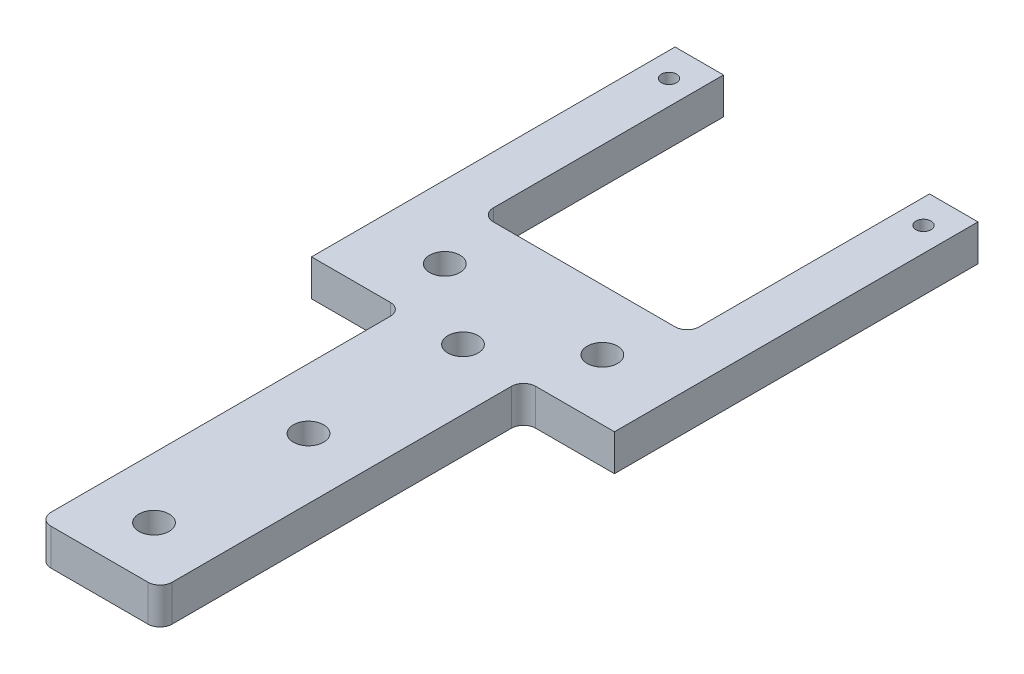
ISO-10303-21;
HEADER;
FILE_DESCRIPTION(('STEP AP214'),'2;1');
FILE_NAME('part.step','',(''),(''),'','','');
FILE_SCHEMA(('AUTOMOTIVE_DESIGN { 1 0 10303 214 1 1 1 1 }'));
ENDSEC;
DATA;
#1=APPLICATION_CONTEXT('core data for automotive mechanical design processes');
#2=APPLICATION_PROTOCOL_DEFINITION('international standard','automotive_design',2000,#1);
#3=PRODUCT_CONTEXT('',#1,'mechanical');
#4=PRODUCT('Part','Part','',(#3));
#5=PRODUCT_RELATED_PRODUCT_CATEGORY('part','',(#4));
#6=PRODUCT_DEFINITION_FORMATION('','',#4);
#7=PRODUCT_DEFINITION_CONTEXT('part definition',#1,'design');
#8=PRODUCT_DEFINITION('design','',#6,#7);
#9=PRODUCT_DEFINITION_SHAPE('','',#8);
#10=(LENGTH_UNIT() NAMED_UNIT(*) SI_UNIT(.MILLI.,.METRE.));
#11=(NAMED_UNIT(*) PLANE_ANGLE_UNIT() SI_UNIT($,.RADIAN.));
#12=(NAMED_UNIT(*) SI_UNIT($,.STERADIAN.) SOLID_ANGLE_UNIT());
#13=UNCERTAINTY_MEASURE_WITH_UNIT(LENGTH_MEASURE(1.E-05),#10,'distance_accuracy_value','');
#14=(GEOMETRIC_REPRESENTATION_CONTEXT(3) GLOBAL_UNCERTAINTY_ASSIGNED_CONTEXT((#13)) GLOBAL_UNIT_ASSIGNED_CONTEXT((#10,
#11,#12)) REPRESENTATION_CONTEXT('',''));
#15=CARTESIAN_POINT('',(0.,0.,0.));
#16=DIRECTION('',(0.,0.,1.));
#17=DIRECTION('',(1.,0.,0.));
#18=AXIS2_PLACEMENT_3D('',#15,#16,#17);
#19=CARTESIAN_POINT('',(0.,1.5,-10.));
#20=DIRECTION('',(0.,0.,-1.));
#21=DIRECTION('',(-1.,0.,0.));
#22=AXIS2_PLACEMENT_3D('',#19,#20,#21);
#23=PLANE('',#22);
#24=DIRECTION('',(1.,0.,0.));
#25=VECTOR('',#24,1.);
#26=CARTESIAN_POINT('',(0.,1.5,-10.));
#27=LINE('',#26,#25);
#28=CARTESIAN_POINT('',(-7.5,1.5,-10.));
#29=VERTEX_POINT('',#28);
#30=CARTESIAN_POINT('',(7.5,1.5,-10.));
#31=VERTEX_POINT('',#30);
#32=EDGE_CURVE('E173',#29,#31,#27,.T.);
#33=ORIENTED_EDGE('',*,*,#32,.T.);
#34=DIRECTION('',(0.,-1.,0.));
#35=VECTOR('',#34,1.);
#36=CARTESIAN_POINT('',(7.5,-1.5,-10.));
#37=LINE('',#36,#35);
#38=CARTESIAN_POINT('',(7.5,-1.5,-10.));
#39=VERTEX_POINT('',#38);
#40=EDGE_CURVE('E325',#31,#39,#37,.T.);
#41=ORIENTED_EDGE('',*,*,#40,.T.);
#42=DIRECTION('',(1.,0.,0.));
#43=VECTOR('',#42,1.);
#44=CARTESIAN_POINT('',(0.,-1.5,-10.));
#45=LINE('',#44,#43);
#46=CARTESIAN_POINT('',(-7.5,-1.5,-10.));
#47=VERTEX_POINT('',#46);
#48=EDGE_CURVE('E234',#47,#39,#45,.T.);
#49=ORIENTED_EDGE('',*,*,#48,.F.);
#50=DIRECTION('',(0.,-1.,0.));
#51=VECTOR('',#50,1.);
#52=CARTESIAN_POINT('',(-7.5,1.5,-10.));
#53=LINE('',#52,#51);
#54=EDGE_CURVE('E323',#47,#29,#53,.F.);
#55=ORIENTED_EDGE('',*,*,#54,.T.);
#56=EDGE_LOOP('',(#33,#41,#49,#55));
#57=FACE_BOUND('',#56,.T.);
#58=ADVANCED_FACE('F35',(#57),#23,.T.);
#59=CARTESIAN_POINT('',(-8.5,1.5,0.));
#60=DIRECTION('',(-1.,0.,0.));
#61=DIRECTION('',(0.,0.,1.));
#62=AXIS2_PLACEMENT_3D('',#59,#60,#61);
#63=PLANE('',#62);
#64=DIRECTION('',(0.,0.,-1.));
#65=VECTOR('',#64,1.);
#66=CARTESIAN_POINT('',(-8.5,1.5,0.));
#67=LINE('',#66,#65);
#68=CARTESIAN_POINT('',(-8.5,1.5,-11.));
#69=VERTEX_POINT('',#68);
#70=CARTESIAN_POINT('',(-8.5,1.5,-30.));
#71=VERTEX_POINT('',#70);
#72=EDGE_CURVE('E159',#69,#71,#67,.T.);
#73=ORIENTED_EDGE('',*,*,#72,.F.);
#74=DIRECTION('',(0.,-1.,0.));
#75=VECTOR('',#74,1.);
#76=CARTESIAN_POINT('',(-8.5,1.5,-11.));
#77=LINE('',#76,#75);
#78=CARTESIAN_POINT('',(-8.5,-1.5,-11.));
#79=VERTEX_POINT('',#78);
#80=EDGE_CURVE('E329',#69,#79,#77,.T.);
#81=ORIENTED_EDGE('',*,*,#80,.T.);
#82=DIRECTION('',(0.,0.,-1.));
#83=VECTOR('',#82,1.);
#84=CARTESIAN_POINT('',(-8.5,-1.5,0.));
#85=LINE('',#84,#83);
#86=CARTESIAN_POINT('',(-8.5,-1.5,-30.));
#87=VERTEX_POINT('',#86);
#88=EDGE_CURVE('E179',#79,#87,#85,.T.);
#89=ORIENTED_EDGE('',*,*,#88,.T.);
#90=DIRECTION('',(0.,-1.,0.));
#91=VECTOR('',#90,1.);
#92=CARTESIAN_POINT('',(-8.5,1.5,-30.));
#93=LINE('',#92,#91);
#94=EDGE_CURVE('E176',#71,#87,#93,.T.);
#95=ORIENTED_EDGE('',*,*,#94,.F.);
#96=EDGE_LOOP('',(#73,#81,#89,#95));
#97=FACE_BOUND('',#96,.T.);
#98=ADVANCED_FACE('F177',(#97),#63,.F.);
#99=CARTESIAN_POINT('',(0.,1.5,-30.));
#100=DIRECTION('',(0.,0.,1.));
#101=DIRECTION('',(1.,0.,0.));
#102=AXIS2_PLACEMENT_3D('',#99,#100,#101);
#103=PLANE('',#102);
#104=DIRECTION('',(-1.,0.,0.));
#105=VECTOR('',#104,1.);
#106=CARTESIAN_POINT('',(0.,-1.5,-30.));
#107=LINE('',#106,#105);
#108=CARTESIAN_POINT('',(-12.5,-1.5,-30.));
#109=VERTEX_POINT('',#108);
#110=EDGE_CURVE('E238',#87,#109,#107,.T.);
#111=ORIENTED_EDGE('',*,*,#110,.T.);
#112=DIRECTION('',(0.,-1.,0.));
#113=VECTOR('',#112,1.);
#114=CARTESIAN_POINT('',(-12.5,1.5,-30.));
#115=LINE('',#114,#113);
#116=CARTESIAN_POINT('',(-12.5,1.5,-30.));
#117=VERTEX_POINT('',#116);
#118=EDGE_CURVE('E184',#117,#109,#115,.T.);
#119=ORIENTED_EDGE('',*,*,#118,.F.);
#120=DIRECTION('',(-1.,0.,0.));
#121=VECTOR('',#120,1.);
#122=CARTESIAN_POINT('',(0.,1.5,-30.));
#123=LINE('',#122,#121);
#124=EDGE_CURVE('E166',#71,#117,#123,.T.);
#125=ORIENTED_EDGE('',*,*,#124,.F.);
#126=ORIENTED_EDGE('',*,*,#94,.T.);
#127=EDGE_LOOP('',(#111,#119,#125,#126));
#128=FACE_BOUND('',#127,.T.);
#129=ADVANCED_FACE('F186',(#128),#103,.F.);
#130=CARTESIAN_POINT('',(-12.5,1.5,0.));
#131=DIRECTION('',(-1.,0.,0.));
#132=DIRECTION('',(0.,0.,1.));
#133=AXIS2_PLACEMENT_3D('',#130,#131,#132);
#134=PLANE('',#133);
#135=DIRECTION('',(0.,0.,-1.));
#136=VECTOR('',#135,1.);
#137=CARTESIAN_POINT('',(-12.5,-1.5,0.));
#138=LINE('',#137,#136);
#139=CARTESIAN_POINT('',(-12.5,-1.5,0.));
#140=VERTEX_POINT('',#139);
#141=EDGE_CURVE('E240',#140,#109,#138,.T.);
#142=ORIENTED_EDGE('',*,*,#141,.F.);
#143=DIRECTION('',(0.,-1.,0.));
#144=VECTOR('',#143,1.);
#145=CARTESIAN_POINT('',(-12.5,1.5,0.));
#146=LINE('',#145,#144);
#147=CARTESIAN_POINT('',(-12.5,1.5,0.));
#148=VERTEX_POINT('',#147);
#149=EDGE_CURVE('E293',#148,#140,#146,.T.);
#150=ORIENTED_EDGE('',*,*,#149,.F.);
#151=DIRECTION('',(0.,0.,-1.));
#152=VECTOR('',#151,1.);
#153=CARTESIAN_POINT('',(-12.5,1.5,0.));
#154=LINE('',#153,#152);
#155=EDGE_CURVE('E188',#148,#117,#154,.T.);
#156=ORIENTED_EDGE('',*,*,#155,.T.);
#157=ORIENTED_EDGE('',*,*,#118,.T.);
#158=EDGE_LOOP('',(#142,#150,#156,#157));
#159=FACE_BOUND('',#158,.T.);
#160=ADVANCED_FACE('F437',(#159),#134,.T.);
#161=CARTESIAN_POINT('',(0.,1.5,0.));
#162=DIRECTION('',(0.,0.,-1.));
#163=DIRECTION('',(-1.,0.,0.));
#164=AXIS2_PLACEMENT_3D('',#161,#162,#163);
#165=PLANE('',#164);
#166=DIRECTION('',(1.,0.,0.));
#167=VECTOR('',#166,1.);
#168=CARTESIAN_POINT('',(0.,-1.5,0.));
#169=LINE('',#168,#167);
#170=CARTESIAN_POINT('',(-6.,-1.5,0.));
#171=VERTEX_POINT('',#170);
#172=EDGE_CURVE('E243',#140,#171,#169,.T.);
#173=ORIENTED_EDGE('',*,*,#172,.T.);
#174=DIRECTION('',(0.,-1.,0.));
#175=VECTOR('',#174,1.);
#176=CARTESIAN_POINT('',(-6.,1.5,0.));
#177=LINE('',#176,#175);
#178=CARTESIAN_POINT('',(-6.,1.5,0.));
#179=VERTEX_POINT('',#178);
#180=EDGE_CURVE('E318',#171,#179,#177,.F.);
#181=ORIENTED_EDGE('',*,*,#180,.T.);
#182=DIRECTION('',(1.,0.,0.));
#183=VECTOR('',#182,1.);
#184=CARTESIAN_POINT('',(0.,1.5,0.));
#185=LINE('',#184,#183);
#186=EDGE_CURVE('E190',#148,#179,#185,.T.);
#187=ORIENTED_EDGE('',*,*,#186,.F.);
#188=ORIENTED_EDGE('',*,*,#149,.T.);
#189=EDGE_LOOP('',(#173,#181,#187,#188));
#190=FACE_BOUND('',#189,.T.);
#191=ADVANCED_FACE('F433',(#190),#165,.F.);
#192=CARTESIAN_POINT('',(-5.,1.5,0.));
#193=DIRECTION('',(-1.,0.,0.));
#194=DIRECTION('',(0.,0.,1.));
#195=AXIS2_PLACEMENT_3D('',#192,#193,#194);
#196=PLANE('',#195);
#197=DIRECTION('',(0.,0.,-1.));
#198=VECTOR('',#197,1.);
#199=CARTESIAN_POINT('',(-5.,-1.5,0.));
#200=LINE('',#199,#198);
#201=CARTESIAN_POINT('',(-5.,-1.5,29.));
#202=VERTEX_POINT('',#201);
#203=CARTESIAN_POINT('',(-5.,-1.5,0.999999999999999));
#204=VERTEX_POINT('',#203);
#205=EDGE_CURVE('E246',#202,#204,#200,.T.);
#206=ORIENTED_EDGE('',*,*,#205,.F.);
#207=DIRECTION('',(0.,-1.,0.));
#208=VECTOR('',#207,1.);
#209=CARTESIAN_POINT('',(-5.,1.5,29.));
#210=LINE('',#209,#208);
#211=CARTESIAN_POINT('',(-5.,1.5,29.));
#212=VERTEX_POINT('',#211);
#213=EDGE_CURVE('E316',#202,#212,#210,.F.);
#214=ORIENTED_EDGE('',*,*,#213,.T.);
#215=DIRECTION('',(0.,0.,-1.));
#216=VECTOR('',#215,1.);
#217=CARTESIAN_POINT('',(-5.,1.5,0.));
#218=LINE('',#217,#216);
#219=CARTESIAN_POINT('',(-5.,1.5,0.999999999999999));
#220=VERTEX_POINT('',#219);
#221=EDGE_CURVE('E196',#212,#220,#218,.T.);
#222=ORIENTED_EDGE('',*,*,#221,.T.);
#223=DIRECTION('',(0.,-1.,0.));
#224=VECTOR('',#223,1.);
#225=CARTESIAN_POINT('',(-5.,1.5,0.999999999999999));
#226=LINE('',#225,#224);
#227=EDGE_CURVE('E313',#220,#204,#226,.T.);
#228=ORIENTED_EDGE('',*,*,#227,.T.);
#229=EDGE_LOOP('',(#206,#214,#222,#228));
#230=FACE_BOUND('',#229,.T.);
#231=ADVANCED_FACE('F429',(#230),#196,.T.);
#232=CARTESIAN_POINT('',(0.,1.5,30.));
#233=DIRECTION('',(0.,0.,-1.));
#234=DIRECTION('',(-1.,0.,0.));
#235=AXIS2_PLACEMENT_3D('',#232,#233,#234);
#236=PLANE('',#235);
#237=DIRECTION('',(1.,0.,0.));
#238=VECTOR('',#237,1.);
#239=CARTESIAN_POINT('',(0.,-1.5,30.));
#240=LINE('',#239,#238);
#241=CARTESIAN_POINT('',(-4.,-1.5,30.));
#242=VERTEX_POINT('',#241);
#243=CARTESIAN_POINT('',(4.,-1.5,30.));
#244=VERTEX_POINT('',#243);
#245=EDGE_CURVE('E249',#242,#244,#240,.T.);
#246=ORIENTED_EDGE('',*,*,#245,.T.);
#247=DIRECTION('',(0.,-1.,0.));
#248=VECTOR('',#247,1.);
#249=CARTESIAN_POINT('',(4.,1.5,30.));
#250=LINE('',#249,#248);
#251=CARTESIAN_POINT('',(4.,1.5,30.));
#252=VERTEX_POINT('',#251);
#253=EDGE_CURVE('E307',#244,#252,#250,.F.);
#254=ORIENTED_EDGE('',*,*,#253,.T.);
#255=DIRECTION('',(1.,0.,0.));
#256=VECTOR('',#255,1.);
#257=CARTESIAN_POINT('',(0.,1.5,30.));
#258=LINE('',#257,#256);
#259=CARTESIAN_POINT('',(-4.,1.5,30.));
#260=VERTEX_POINT('',#259);
#261=EDGE_CURVE('E199',#260,#252,#258,.T.);
#262=ORIENTED_EDGE('',*,*,#261,.F.);
#263=DIRECTION('',(0.,-1.,0.));
#264=VECTOR('',#263,1.);
#265=CARTESIAN_POINT('',(-4.,-1.5,30.));
#266=LINE('',#265,#264);
#267=EDGE_CURVE('E304',#260,#242,#266,.T.);
#268=ORIENTED_EDGE('',*,*,#267,.T.);
#269=EDGE_LOOP('',(#246,#254,#262,#268));
#270=FACE_BOUND('',#269,.T.);
#271=ADVANCED_FACE('F425',(#270),#236,.F.);
#272=CARTESIAN_POINT('',(5.,1.5,0.));
#273=DIRECTION('',(-1.,0.,0.));
#274=DIRECTION('',(0.,0.,1.));
#275=AXIS2_PLACEMENT_3D('',#272,#273,#274);
#276=PLANE('',#275);
#277=DIRECTION('',(0.,0.,-1.));
#278=VECTOR('',#277,1.);
#279=CARTESIAN_POINT('',(5.,1.5,0.));
#280=LINE('',#279,#278);
#281=CARTESIAN_POINT('',(5.,1.5,29.));
#282=VERTEX_POINT('',#281);
#283=CARTESIAN_POINT('',(5.,1.5,1.));
#284=VERTEX_POINT('',#283);
#285=EDGE_CURVE('E201',#282,#284,#280,.T.);
#286=ORIENTED_EDGE('',*,*,#285,.F.);
#287=DIRECTION('',(0.,-1.,0.));
#288=VECTOR('',#287,1.);
#289=CARTESIAN_POINT('',(5.,1.5,29.));
#290=LINE('',#289,#288);
#291=CARTESIAN_POINT('',(5.,-1.5,29.));
#292=VERTEX_POINT('',#291);
#293=EDGE_CURVE('E297',#282,#292,#290,.T.);
#294=ORIENTED_EDGE('',*,*,#293,.T.);
#295=DIRECTION('',(0.,0.,-1.));
#296=VECTOR('',#295,1.);
#297=CARTESIAN_POINT('',(5.,-1.5,0.));
#298=LINE('',#297,#296);
#299=CARTESIAN_POINT('',(5.,-1.5,1.));
#300=VERTEX_POINT('',#299);
#301=EDGE_CURVE('E252',#292,#300,#298,.T.);
#302=ORIENTED_EDGE('',*,*,#301,.T.);
#303=DIRECTION('',(0.,-1.,0.));
#304=VECTOR('',#303,1.);
#305=CARTESIAN_POINT('',(5.,1.5,1.));
#306=LINE('',#305,#304);
#307=EDGE_CURVE('E183',#300,#284,#306,.F.);
#308=ORIENTED_EDGE('',*,*,#307,.T.);
#309=EDGE_LOOP('',(#286,#294,#302,#308));
#310=FACE_BOUND('',#309,.T.);
#311=ADVANCED_FACE('F422',(#310),#276,.F.);
#312=CARTESIAN_POINT('',(0.,1.5,0.));
#313=DIRECTION('',(0.,0.,-1.));
#314=DIRECTION('',(-1.,0.,0.));
#315=AXIS2_PLACEMENT_3D('',#312,#313,#314);
#316=PLANE('',#315);
#317=DIRECTION('',(1.,0.,0.));
#318=VECTOR('',#317,1.);
#319=CARTESIAN_POINT('',(0.,1.5,0.));
#320=LINE('',#319,#318);
#321=CARTESIAN_POINT('',(6.,1.5,0.));
#322=VERTEX_POINT('',#321);
#323=CARTESIAN_POINT('',(12.5,1.5,0.));
#324=VERTEX_POINT('',#323);
#325=EDGE_CURVE('E203',#322,#324,#320,.T.);
#326=ORIENTED_EDGE('',*,*,#325,.F.);
#327=DIRECTION('',(0.,-1.,0.));
#328=VECTOR('',#327,1.);
#329=CARTESIAN_POINT('',(6.,-1.5,0.));
#330=LINE('',#329,#328);
#331=CARTESIAN_POINT('',(6.,-1.5,0.));
#332=VERTEX_POINT('',#331);
#333=EDGE_CURVE('E320',#322,#332,#330,.T.);
#334=ORIENTED_EDGE('',*,*,#333,.T.);
#335=DIRECTION('',(1.,0.,0.));
#336=VECTOR('',#335,1.);
#337=CARTESIAN_POINT('',(0.,-1.5,0.));
#338=LINE('',#337,#336);
#339=CARTESIAN_POINT('',(12.5,-1.5,0.));
#340=VERTEX_POINT('',#339);
#341=EDGE_CURVE('E255',#332,#340,#338,.T.);
#342=ORIENTED_EDGE('',*,*,#341,.T.);
#343=DIRECTION('',(0.,-1.,0.));
#344=VECTOR('',#343,1.);
#345=CARTESIAN_POINT('',(12.5,1.5,0.));
#346=LINE('',#345,#344);
#347=EDGE_CURVE('E290',#324,#340,#346,.T.);
#348=ORIENTED_EDGE('',*,*,#347,.F.);
#349=EDGE_LOOP('',(#326,#334,#342,#348));
#350=FACE_BOUND('',#349,.T.);
#351=ADVANCED_FACE('F386',(#350),#316,.F.);
#352=CARTESIAN_POINT('',(12.5,1.5,0.));
#353=DIRECTION('',(-1.,0.,0.));
#354=DIRECTION('',(0.,0.,1.));
#355=AXIS2_PLACEMENT_3D('',#352,#353,#354);
#356=PLANE('',#355);
#357=DIRECTION('',(0.,0.,-1.));
#358=VECTOR('',#357,1.);
#359=CARTESIAN_POINT('',(12.5,-1.5,0.));
#360=LINE('',#359,#358);
#361=CARTESIAN_POINT('',(12.5,-1.5,-30.));
#362=VERTEX_POINT('',#361);
#363=EDGE_CURVE('E257',#340,#362,#360,.T.);
#364=ORIENTED_EDGE('',*,*,#363,.T.);
#365=DIRECTION('',(0.,-1.,0.));
#366=VECTOR('',#365,1.);
#367=CARTESIAN_POINT('',(12.5,1.5,-30.));
#368=LINE('',#367,#366);
#369=CARTESIAN_POINT('',(12.5,1.5,-30.));
#370=VERTEX_POINT('',#369);
#371=EDGE_CURVE('E288',#370,#362,#368,.T.);
#372=ORIENTED_EDGE('',*,*,#371,.F.);
#373=DIRECTION('',(0.,0.,-1.));
#374=VECTOR('',#373,1.);
#375=CARTESIAN_POINT('',(12.5,1.5,0.));
#376=LINE('',#375,#374);
#377=EDGE_CURVE('E205',#324,#370,#376,.T.);
#378=ORIENTED_EDGE('',*,*,#377,.F.);
#379=ORIENTED_EDGE('',*,*,#347,.T.);
#380=EDGE_LOOP('',(#364,#372,#378,#379));
#381=FACE_BOUND('',#380,.T.);
#382=ADVANCED_FACE('F392',(#381),#356,.F.);
#383=CARTESIAN_POINT('',(0.,1.5,-30.));
#384=DIRECTION('',(0.,0.,-1.));
#385=DIRECTION('',(-1.,0.,0.));
#386=AXIS2_PLACEMENT_3D('',#383,#384,#385);
#387=PLANE('',#386);
#388=DIRECTION('',(1.,0.,0.));
#389=VECTOR('',#388,1.);
#390=CARTESIAN_POINT('',(0.,-1.5,-30.));
#391=LINE('',#390,#389);
#392=CARTESIAN_POINT('',(8.49999999999999,-1.5,-30.));
#393=VERTEX_POINT('',#392);
#394=EDGE_CURVE('E260',#393,#362,#391,.T.);
#395=ORIENTED_EDGE('',*,*,#394,.F.);
#396=DIRECTION('',(0.,-1.,0.));
#397=VECTOR('',#396,1.);
#398=CARTESIAN_POINT('',(8.49999999999999,1.5,-30.));
#399=LINE('',#398,#397);
#400=CARTESIAN_POINT('',(8.49999999999999,1.5,-30.));
#401=VERTEX_POINT('',#400);
#402=EDGE_CURVE('E233',#401,#393,#399,.T.);
#403=ORIENTED_EDGE('',*,*,#402,.F.);
#404=DIRECTION('',(1.,0.,0.));
#405=VECTOR('',#404,1.);
#406=CARTESIAN_POINT('',(0.,1.5,-30.));
#407=LINE('',#406,#405);
#408=EDGE_CURVE('E207',#401,#370,#407,.T.);
#409=ORIENTED_EDGE('',*,*,#408,.T.);
#410=ORIENTED_EDGE('',*,*,#371,.T.);
#411=EDGE_LOOP('',(#395,#403,#409,#410));
#412=FACE_BOUND('',#411,.T.);
#413=ADVANCED_FACE('F398',(#412),#387,.T.);
#414=CARTESIAN_POINT('',(10.5,1.5,-27.5));
#415=DIRECTION('',(0.,-1.,0.));
#416=DIRECTION('',(0.,0.,-1.));
#417=AXIS2_PLACEMENT_3D('',#414,#415,#416);
#418=CYLINDRICAL_SURFACE('',#417,0.625000000000001);
#419=CARTESIAN_POINT('',(10.5,1.5,-27.5));
#420=DIRECTION('',(0.,1.,0.));
#421=DIRECTION('',(0.,0.,1.));
#422=AXIS2_PLACEMENT_3D('',#419,#420,#421);
#423=CIRCLE('',#422,0.625000000000001);
#424=CARTESIAN_POINT('',(10.5,1.5,-26.875));
#425=VERTEX_POINT('',#424);
#426=EDGE_CURVE('E227',#425,#425,#423,.F.);
#427=ORIENTED_EDGE('',*,*,#426,.F.);
#428=EDGE_LOOP('',(#427));
#429=FACE_BOUND('',#428,.T.);
#430=CARTESIAN_POINT('',(10.5,-1.5,-27.5));
#431=DIRECTION('',(0.,1.,0.));
#432=DIRECTION('',(0.,0.,1.));
#433=AXIS2_PLACEMENT_3D('',#430,#431,#432);
#434=CIRCLE('',#433,0.625000000000001);
#435=CARTESIAN_POINT('',(10.5,-1.5,-26.875));
#436=VERTEX_POINT('',#435);
#437=EDGE_CURVE('E280',#436,#436,#434,.F.);
#438=ORIENTED_EDGE('',*,*,#437,.T.);
#439=EDGE_LOOP('',(#438));
#440=FACE_BOUND('',#439,.T.);
#441=ADVANCED_FACE('F417',(#429,#440),#418,.F.);
#442=CARTESIAN_POINT('',(-6.5,1.5,-5.00000000000001));
#443=DIRECTION('',(0.,-1.,0.));
#444=DIRECTION('',(0.,0.,-1.));
#445=AXIS2_PLACEMENT_3D('',#442,#443,#444);
#446=CYLINDRICAL_SURFACE('',#445,1.25);
#447=CARTESIAN_POINT('',(-6.5,1.5,-5.00000000000001));
#448=DIRECTION('',(0.,1.,0.));
#449=DIRECTION('',(0.,0.,1.));
#450=AXIS2_PLACEMENT_3D('',#447,#448,#449);
#451=CIRCLE('',#450,1.25);
#452=CARTESIAN_POINT('',(-6.5,1.5,-3.75));
#453=VERTEX_POINT('',#452);
#454=EDGE_CURVE('E224',#453,#453,#451,.T.);
#455=ORIENTED_EDGE('',*,*,#454,.T.);
#456=EDGE_LOOP('',(#455));
#457=FACE_BOUND('',#456,.T.);
#458=CARTESIAN_POINT('',(-6.5,-1.5,-5.00000000000001));
#459=DIRECTION('',(0.,1.,0.));
#460=DIRECTION('',(0.,0.,1.));
#461=AXIS2_PLACEMENT_3D('',#458,#459,#460);
#462=CIRCLE('',#461,1.25);
#463=CARTESIAN_POINT('',(-6.5,-1.5,-3.75));
#464=VERTEX_POINT('',#463);
#465=EDGE_CURVE('E277',#464,#464,#462,.T.);
#466=ORIENTED_EDGE('',*,*,#465,.F.);
#467=EDGE_LOOP('',(#466));
#468=FACE_BOUND('',#467,.T.);
#469=ADVANCED_FACE('F484',(#457,#468),#446,.F.);
#470=CARTESIAN_POINT('',(6.5,1.5,-5.00000000000001));
#471=DIRECTION('',(0.,-1.,0.));
#472=DIRECTION('',(0.,0.,-1.));
#473=AXIS2_PLACEMENT_3D('',#470,#471,#472);
#474=CYLINDRICAL_SURFACE('',#473,1.25);
#475=CARTESIAN_POINT('',(6.5,1.5,-5.00000000000001));
#476=DIRECTION('',(0.,1.,0.));
#477=DIRECTION('',(0.,0.,1.));
#478=AXIS2_PLACEMENT_3D('',#475,#476,#477);
#479=CIRCLE('',#478,1.25);
#480=CARTESIAN_POINT('',(6.5,1.5,-3.75000000000001));
#481=VERTEX_POINT('',#480);
#482=EDGE_CURVE('E221',#481,#481,#479,.F.);
#483=ORIENTED_EDGE('',*,*,#482,.F.);
#484=EDGE_LOOP('',(#483));
#485=FACE_BOUND('',#484,.T.);
#486=CARTESIAN_POINT('',(6.5,-1.5,-5.00000000000001));
#487=DIRECTION('',(0.,1.,0.));
#488=DIRECTION('',(0.,0.,1.));
#489=AXIS2_PLACEMENT_3D('',#486,#487,#488);
#490=CIRCLE('',#489,1.25);
#491=CARTESIAN_POINT('',(6.5,-1.5,-3.75000000000001));
#492=VERTEX_POINT('',#491);
#493=EDGE_CURVE('E274',#492,#492,#490,.F.);
#494=ORIENTED_EDGE('',*,*,#493,.T.);
#495=EDGE_LOOP('',(#494));
#496=FACE_BOUND('',#495,.T.);
#497=ADVANCED_FACE('F492',(#485,#496),#474,.F.);
#498=CARTESIAN_POINT('',(0.,1.5,12.75));
#499=DIRECTION('',(0.,-1.,0.));
#500=DIRECTION('',(0.,0.,-1.));
#501=AXIS2_PLACEMENT_3D('',#498,#499,#500);
#502=CYLINDRICAL_SURFACE('',#501,1.25);
#503=CARTESIAN_POINT('',(0.,1.5,12.75));
#504=DIRECTION('',(0.,1.,0.));
#505=DIRECTION('',(0.,0.,1.));
#506=AXIS2_PLACEMENT_3D('',#503,#504,#505);
#507=CIRCLE('',#506,1.25);
#508=CARTESIAN_POINT('',(0.,1.5,14.));
#509=VERTEX_POINT('',#508);
#510=EDGE_CURVE('E218',#509,#509,#507,.T.);
#511=ORIENTED_EDGE('',*,*,#510,.T.);
#512=EDGE_LOOP('',(#511));
#513=FACE_BOUND('',#512,.T.);
#514=CARTESIAN_POINT('',(0.,-1.5,12.75));
#515=DIRECTION('',(0.,1.,0.));
#516=DIRECTION('',(0.,0.,1.));
#517=AXIS2_PLACEMENT_3D('',#514,#515,#516);
#518=CIRCLE('',#517,1.25);
#519=CARTESIAN_POINT('',(0.,-1.5,14.));
#520=VERTEX_POINT('',#519);
#521=EDGE_CURVE('E271',#520,#520,#518,.T.);
#522=ORIENTED_EDGE('',*,*,#521,.F.);
#523=EDGE_LOOP('',(#522));
#524=FACE_BOUND('',#523,.T.);
#525=ADVANCED_FACE('F500',(#513,#524),#502,.F.);
#526=CARTESIAN_POINT('',(0.,1.5,0.));
#527=DIRECTION('',(0.,-1.,0.));
#528=DIRECTION('',(0.,0.,-1.));
#529=AXIS2_PLACEMENT_3D('',#526,#527,#528);
#530=CYLINDRICAL_SURFACE('',#529,1.25);
#531=CARTESIAN_POINT('',(0.,1.5,0.));
#532=DIRECTION('',(0.,1.,0.));
#533=DIRECTION('',(0.,0.,1.));
#534=AXIS2_PLACEMENT_3D('',#531,#532,#533);
#535=CIRCLE('',#534,1.25);
#536=CARTESIAN_POINT('',(0.,1.5,1.25));
#537=VERTEX_POINT('',#536);
#538=EDGE_CURVE('E215',#537,#537,#535,.T.);
#539=ORIENTED_EDGE('',*,*,#538,.T.);
#540=EDGE_LOOP('',(#539));
#541=FACE_BOUND('',#540,.T.);
#542=CARTESIAN_POINT('',(0.,-1.5,0.));
#543=DIRECTION('',(0.,1.,0.));
#544=DIRECTION('',(0.,0.,1.));
#545=AXIS2_PLACEMENT_3D('',#542,#543,#544);
#546=CIRCLE('',#545,1.25);
#547=CARTESIAN_POINT('',(0.,-1.5,1.25));
#548=VERTEX_POINT('',#547);
#549=EDGE_CURVE('E268',#548,#548,#546,.T.);
#550=ORIENTED_EDGE('',*,*,#549,.F.);
#551=EDGE_LOOP('',(#550));
#552=FACE_BOUND('',#551,.T.);
#553=ADVANCED_FACE('F410',(#541,#552),#530,.F.);
#554=CARTESIAN_POINT('',(0.,1.5,25.5));
#555=DIRECTION('',(0.,-1.,0.));
#556=DIRECTION('',(0.,0.,-1.));
#557=AXIS2_PLACEMENT_3D('',#554,#555,#556);
#558=CYLINDRICAL_SURFACE('',#557,1.25);
#559=CARTESIAN_POINT('',(0.,1.5,25.5));
#560=DIRECTION('',(0.,1.,0.));
#561=DIRECTION('',(0.,0.,1.));
#562=AXIS2_PLACEMENT_3D('',#559,#560,#561);
#563=CIRCLE('',#562,1.25);
#564=CARTESIAN_POINT('',(0.,1.5,26.75));
#565=VERTEX_POINT('',#564);
#566=EDGE_CURVE('E212',#565,#565,#563,.T.);
#567=ORIENTED_EDGE('',*,*,#566,.T.);
#568=EDGE_LOOP('',(#567));
#569=FACE_BOUND('',#568,.T.);
#570=CARTESIAN_POINT('',(0.,-1.5,25.5));
#571=DIRECTION('',(0.,1.,0.));
#572=DIRECTION('',(0.,0.,1.));
#573=AXIS2_PLACEMENT_3D('',#570,#571,#572);
#574=CIRCLE('',#573,1.25);
#575=CARTESIAN_POINT('',(0.,-1.5,26.75));
#576=VERTEX_POINT('',#575);
#577=EDGE_CURVE('E265',#576,#576,#574,.T.);
#578=ORIENTED_EDGE('',*,*,#577,.F.);
#579=EDGE_LOOP('',(#578));
#580=FACE_BOUND('',#579,.T.);
#581=ADVANCED_FACE('F402',(#569,#580),#558,.F.);
#582=CARTESIAN_POINT('',(8.5,1.5,0.));
#583=DIRECTION('',(-1.,0.,0.));
#584=DIRECTION('',(0.,0.,1.));
#585=AXIS2_PLACEMENT_3D('',#582,#583,#584);
#586=PLANE('',#585);
#587=DIRECTION('',(0.,0.,-1.));
#588=VECTOR('',#587,1.);
#589=CARTESIAN_POINT('',(8.5,-1.5,0.));
#590=LINE('',#589,#588);
#591=CARTESIAN_POINT('',(8.5,-1.5,-11.));
#592=VERTEX_POINT('',#591);
#593=EDGE_CURVE('E263',#592,#393,#590,.T.);
#594=ORIENTED_EDGE('',*,*,#593,.F.);
#595=DIRECTION('',(0.,-1.,0.));
#596=VECTOR('',#595,1.);
#597=CARTESIAN_POINT('',(8.5,1.5,-11.));
#598=LINE('',#597,#596);
#599=CARTESIAN_POINT('',(8.5,1.5,-11.));
#600=VERTEX_POINT('',#599);
#601=EDGE_CURVE('E50',#592,#600,#598,.F.);
#602=ORIENTED_EDGE('',*,*,#601,.T.);
#603=DIRECTION('',(0.,0.,-1.));
#604=VECTOR('',#603,1.);
#605=CARTESIAN_POINT('',(8.5,1.5,0.));
#606=LINE('',#605,#604);
#607=EDGE_CURVE('E210',#600,#401,#606,.T.);
#608=ORIENTED_EDGE('',*,*,#607,.T.);
#609=ORIENTED_EDGE('',*,*,#402,.T.);
#610=EDGE_LOOP('',(#594,#602,#608,#609));
#611=FACE_BOUND('',#610,.T.);
#612=ADVANCED_FACE('F399',(#611),#586,.T.);
#613=CARTESIAN_POINT('',(-10.5,1.5,-27.5));
#614=DIRECTION('',(0.,-1.,0.));
#615=DIRECTION('',(0.,0.,-1.));
#616=AXIS2_PLACEMENT_3D('',#613,#614,#615);
#617=CYLINDRICAL_SURFACE('',#616,0.625000000000001);
#618=CARTESIAN_POINT('',(-10.5,1.5,-27.5));
#619=DIRECTION('',(0.,1.,0.));
#620=DIRECTION('',(0.,0.,1.));
#621=AXIS2_PLACEMENT_3D('',#618,#619,#620);
#622=CIRCLE('',#621,0.625000000000001);
#623=CARTESIAN_POINT('',(-10.5,1.5,-26.875));
#624=VERTEX_POINT('',#623);
#625=EDGE_CURVE('E230',#624,#624,#622,.T.);
#626=ORIENTED_EDGE('',*,*,#625,.T.);
#627=EDGE_LOOP('',(#626));
#628=FACE_BOUND('',#627,.T.);
#629=CARTESIAN_POINT('',(-10.5,-1.5,-27.5));
#630=DIRECTION('',(0.,1.,0.));
#631=DIRECTION('',(0.,0.,1.));
#632=AXIS2_PLACEMENT_3D('',#629,#630,#631);
#633=CIRCLE('',#632,0.625000000000001);
#634=CARTESIAN_POINT('',(-10.5,-1.5,-26.875));
#635=VERTEX_POINT('',#634);
#636=EDGE_CURVE('E283',#635,#635,#633,.T.);
#637=ORIENTED_EDGE('',*,*,#636,.F.);
#638=EDGE_LOOP('',(#637));
#639=FACE_BOUND('',#638,.T.);
#640=ADVANCED_FACE('F401',(#628,#639),#617,.F.);
#641=CARTESIAN_POINT('',(0.,1.5,0.));
#642=DIRECTION('',(0.,1.,0.));
#643=DIRECTION('',(0.,0.,1.));
#644=AXIS2_PLACEMENT_3D('',#641,#642,#643);
#645=PLANE('',#644);
#646=ORIENTED_EDGE('',*,*,#261,.T.);
#647=CARTESIAN_POINT('',(4.,1.5,29.));
#648=DIRECTION('',(0.,1.,0.));
#649=DIRECTION('',(0.,0.,1.));
#650=AXIS2_PLACEMENT_3D('',#647,#648,#649);
#651=CIRCLE('',#650,1.);
#652=EDGE_CURVE('E311',#252,#282,#651,.T.);
#653=ORIENTED_EDGE('',*,*,#652,.T.);
#654=ORIENTED_EDGE('',*,*,#285,.T.);
#655=CARTESIAN_POINT('',(6.,1.5,1.));
#656=DIRECTION('',(0.,1.,0.));
#657=DIRECTION('',(0.,0.,1.));
#658=AXIS2_PLACEMENT_3D('',#655,#656,#657);
#659=CIRCLE('',#658,1.);
#660=EDGE_CURVE('E58',#284,#322,#659,.F.);
#661=ORIENTED_EDGE('',*,*,#660,.T.);
#662=ORIENTED_EDGE('',*,*,#325,.T.);
#663=ORIENTED_EDGE('',*,*,#377,.T.);
#664=ORIENTED_EDGE('',*,*,#408,.F.);
#665=ORIENTED_EDGE('',*,*,#607,.F.);
#666=CARTESIAN_POINT('',(7.5,1.5,-11.));
#667=DIRECTION('',(0.,1.,0.));
#668=DIRECTION('',(0.,0.,1.));
#669=AXIS2_PLACEMENT_3D('',#666,#667,#668);
#670=CIRCLE('',#669,1.);
#671=EDGE_CURVE('E340',#600,#31,#670,.F.);
#672=ORIENTED_EDGE('',*,*,#671,.T.);
#673=ORIENTED_EDGE('',*,*,#32,.F.);
#674=CARTESIAN_POINT('',(-7.5,1.5,-11.));
#675=DIRECTION('',(0.,1.,0.));
#676=DIRECTION('',(0.,0.,1.));
#677=AXIS2_PLACEMENT_3D('',#674,#675,#676);
#678=CIRCLE('',#677,1.);
#679=EDGE_CURVE('E11',#29,#69,#678,.F.);
#680=ORIENTED_EDGE('',*,*,#679,.T.);
#681=ORIENTED_EDGE('',*,*,#72,.T.);
#682=ORIENTED_EDGE('',*,*,#124,.T.);
#683=ORIENTED_EDGE('',*,*,#155,.F.);
#684=ORIENTED_EDGE('',*,*,#186,.T.);
#685=CARTESIAN_POINT('',(-6.,1.5,0.999999999999999));
#686=DIRECTION('',(0.,1.,0.));
#687=DIRECTION('',(0.,0.,1.));
#688=AXIS2_PLACEMENT_3D('',#685,#686,#687);
#689=CIRCLE('',#688,1.);
#690=EDGE_CURVE('E333',#179,#220,#689,.F.);
#691=ORIENTED_EDGE('',*,*,#690,.T.);
#692=ORIENTED_EDGE('',*,*,#221,.F.);
#693=CARTESIAN_POINT('',(-4.,1.5,29.));
#694=DIRECTION('',(0.,1.,0.));
#695=DIRECTION('',(0.,0.,1.));
#696=AXIS2_PLACEMENT_3D('',#693,#694,#695);
#697=CIRCLE('',#696,1.);
#698=EDGE_CURVE('E309',#212,#260,#697,.T.);
#699=ORIENTED_EDGE('',*,*,#698,.T.);
#700=EDGE_LOOP('',(#646,#653,#654,#661,#662,#663,#664,#665,#672,#673,#680,#681,#682,#683,#684,
#691,#692,#699));
#701=FACE_BOUND('',#700,.T.);
#702=ORIENTED_EDGE('',*,*,#566,.F.);
#703=EDGE_LOOP('',(#702));
#704=FACE_BOUND('',#703,.T.);
#705=ORIENTED_EDGE('',*,*,#538,.F.);
#706=EDGE_LOOP('',(#705));
#707=FACE_BOUND('',#706,.T.);
#708=ORIENTED_EDGE('',*,*,#510,.F.);
#709=EDGE_LOOP('',(#708));
#710=FACE_BOUND('',#709,.T.);
#711=ORIENTED_EDGE('',*,*,#482,.T.);
#712=EDGE_LOOP('',(#711));
#713=FACE_BOUND('',#712,.T.);
#714=ORIENTED_EDGE('',*,*,#454,.F.);
#715=EDGE_LOOP('',(#714));
#716=FACE_BOUND('',#715,.T.);
#717=ORIENTED_EDGE('',*,*,#426,.T.);
#718=EDGE_LOOP('',(#717));
#719=FACE_BOUND('',#718,.T.);
#720=ORIENTED_EDGE('',*,*,#625,.F.);
#721=EDGE_LOOP('',(#720));
#722=FACE_BOUND('',#721,.T.);
#723=ADVANCED_FACE('F162',(#701,#704,#707,#710,#713,#716,#719,#722),#645,.T.);
#724=CARTESIAN_POINT('',(0.,-1.5,0.));
#725=DIRECTION('',(0.,1.,0.));
#726=DIRECTION('',(0.,0.,1.));
#727=AXIS2_PLACEMENT_3D('',#724,#725,#726);
#728=PLANE('',#727);
#729=ORIENTED_EDGE('',*,*,#301,.F.);
#730=CARTESIAN_POINT('',(4.,-1.5,29.));
#731=DIRECTION('',(0.,1.,0.));
#732=DIRECTION('',(0.,0.,1.));
#733=AXIS2_PLACEMENT_3D('',#730,#731,#732);
#734=CIRCLE('',#733,1.);
#735=EDGE_CURVE('E302',#292,#244,#734,.F.);
#736=ORIENTED_EDGE('',*,*,#735,.T.);
#737=ORIENTED_EDGE('',*,*,#245,.F.);
#738=CARTESIAN_POINT('',(-4.,-1.5,29.));
#739=DIRECTION('',(0.,1.,0.));
#740=DIRECTION('',(0.,0.,1.));
#741=AXIS2_PLACEMENT_3D('',#738,#739,#740);
#742=CIRCLE('',#741,1.);
#743=EDGE_CURVE('E300',#242,#202,#742,.F.);
#744=ORIENTED_EDGE('',*,*,#743,.T.);
#745=ORIENTED_EDGE('',*,*,#205,.T.);
#746=CARTESIAN_POINT('',(-6.,-1.5,0.999999999999999));
#747=DIRECTION('',(0.,1.,0.));
#748=DIRECTION('',(0.,0.,1.));
#749=AXIS2_PLACEMENT_3D('',#746,#747,#748);
#750=CIRCLE('',#749,1.);
#751=EDGE_CURVE('E331',#204,#171,#750,.T.);
#752=ORIENTED_EDGE('',*,*,#751,.T.);
#753=ORIENTED_EDGE('',*,*,#172,.F.);
#754=ORIENTED_EDGE('',*,*,#141,.T.);
#755=ORIENTED_EDGE('',*,*,#110,.F.);
#756=ORIENTED_EDGE('',*,*,#88,.F.);
#757=CARTESIAN_POINT('',(-7.5,-1.5,-11.));
#758=DIRECTION('',(0.,1.,0.));
#759=DIRECTION('',(0.,0.,1.));
#760=AXIS2_PLACEMENT_3D('',#757,#758,#759);
#761=CIRCLE('',#760,1.);
#762=EDGE_CURVE('E43',#79,#47,#761,.T.);
#763=ORIENTED_EDGE('',*,*,#762,.T.);
#764=ORIENTED_EDGE('',*,*,#48,.T.);
#765=CARTESIAN_POINT('',(7.5,-1.5,-11.));
#766=DIRECTION('',(0.,1.,0.));
#767=DIRECTION('',(0.,0.,1.));
#768=AXIS2_PLACEMENT_3D('',#765,#766,#767);
#769=CIRCLE('',#768,1.);
#770=EDGE_CURVE('E338',#39,#592,#769,.T.);
#771=ORIENTED_EDGE('',*,*,#770,.T.);
#772=ORIENTED_EDGE('',*,*,#593,.T.);
#773=ORIENTED_EDGE('',*,*,#394,.T.);
#774=ORIENTED_EDGE('',*,*,#363,.F.);
#775=ORIENTED_EDGE('',*,*,#341,.F.);
#776=CARTESIAN_POINT('',(6.,-1.5,1.));
#777=DIRECTION('',(0.,1.,0.));
#778=DIRECTION('',(0.,0.,1.));
#779=AXIS2_PLACEMENT_3D('',#776,#777,#778);
#780=CIRCLE('',#779,1.);
#781=EDGE_CURVE('E335',#332,#300,#780,.T.);
#782=ORIENTED_EDGE('',*,*,#781,.T.);
#783=EDGE_LOOP('',(#729,#736,#737,#744,#745,#752,#753,#754,#755,#756,#763,#764,#771,#772,#773,
#774,#775,#782));
#784=FACE_BOUND('',#783,.T.);
#785=ORIENTED_EDGE('',*,*,#577,.T.);
#786=EDGE_LOOP('',(#785));
#787=FACE_BOUND('',#786,.T.);
#788=ORIENTED_EDGE('',*,*,#549,.T.);
#789=EDGE_LOOP('',(#788));
#790=FACE_BOUND('',#789,.T.);
#791=ORIENTED_EDGE('',*,*,#521,.T.);
#792=EDGE_LOOP('',(#791));
#793=FACE_BOUND('',#792,.T.);
#794=ORIENTED_EDGE('',*,*,#493,.F.);
#795=EDGE_LOOP('',(#794));
#796=FACE_BOUND('',#795,.T.);
#797=ORIENTED_EDGE('',*,*,#465,.T.);
#798=EDGE_LOOP('',(#797));
#799=FACE_BOUND('',#798,.T.);
#800=ORIENTED_EDGE('',*,*,#437,.F.);
#801=EDGE_LOOP('',(#800));
#802=FACE_BOUND('',#801,.T.);
#803=ORIENTED_EDGE('',*,*,#636,.T.);
#804=EDGE_LOOP('',(#803));
#805=FACE_BOUND('',#804,.T.);
#806=ADVANCED_FACE('F344',(#784,#787,#790,#793,#796,#799,#802,#805),#728,.F.);
#807=CARTESIAN_POINT('',(4.,1.5,29.));
#808=DIRECTION('',(0.,-1.,0.));
#809=DIRECTION('',(0.,0.,-1.));
#810=AXIS2_PLACEMENT_3D('',#807,#808,#809);
#811=CYLINDRICAL_SURFACE('',#810,1.);
#812=ORIENTED_EDGE('',*,*,#652,.F.);
#813=ORIENTED_EDGE('',*,*,#253,.F.);
#814=ORIENTED_EDGE('',*,*,#735,.F.);
#815=ORIENTED_EDGE('',*,*,#293,.F.);
#816=EDGE_LOOP('',(#812,#813,#814,#815));
#817=FACE_BOUND('',#816,.T.);
#818=ADVANCED_FACE('F366',(#817),#811,.T.);
#819=CARTESIAN_POINT('',(-4.,1.5,29.));
#820=DIRECTION('',(0.,1.,0.));
#821=DIRECTION('',(0.,0.,1.));
#822=AXIS2_PLACEMENT_3D('',#819,#820,#821);
#823=CYLINDRICAL_SURFACE('',#822,1.);
#824=ORIENTED_EDGE('',*,*,#698,.F.);
#825=ORIENTED_EDGE('',*,*,#213,.F.);
#826=ORIENTED_EDGE('',*,*,#743,.F.);
#827=ORIENTED_EDGE('',*,*,#267,.F.);
#828=EDGE_LOOP('',(#824,#825,#826,#827));
#829=FACE_BOUND('',#828,.T.);
#830=ADVANCED_FACE('F369',(#829),#823,.T.);
#831=CARTESIAN_POINT('',(-6.,1.5,0.999999999999999));
#832=DIRECTION('',(0.,-1.,0.));
#833=DIRECTION('',(0.,0.,-1.));
#834=AXIS2_PLACEMENT_3D('',#831,#832,#833);
#835=CYLINDRICAL_SURFACE('',#834,1.);
#836=ORIENTED_EDGE('',*,*,#690,.F.);
#837=ORIENTED_EDGE('',*,*,#180,.F.);
#838=ORIENTED_EDGE('',*,*,#751,.F.);
#839=ORIENTED_EDGE('',*,*,#227,.F.);
#840=EDGE_LOOP('',(#836,#837,#838,#839));
#841=FACE_BOUND('',#840,.T.);
#842=ADVANCED_FACE('F373',(#841),#835,.F.);
#843=CARTESIAN_POINT('',(6.,1.5,1.));
#844=DIRECTION('',(0.,1.,0.));
#845=DIRECTION('',(0.,0.,1.));
#846=AXIS2_PLACEMENT_3D('',#843,#844,#845);
#847=CYLINDRICAL_SURFACE('',#846,1.);
#848=ORIENTED_EDGE('',*,*,#660,.F.);
#849=ORIENTED_EDGE('',*,*,#307,.F.);
#850=ORIENTED_EDGE('',*,*,#781,.F.);
#851=ORIENTED_EDGE('',*,*,#333,.F.);
#852=EDGE_LOOP('',(#848,#849,#850,#851));
#853=FACE_BOUND('',#852,.T.);
#854=ADVANCED_FACE('F356',(#853),#847,.F.);
#855=CARTESIAN_POINT('',(7.5,1.5,-11.));
#856=DIRECTION('',(0.,1.,0.));
#857=DIRECTION('',(0.,0.,1.));
#858=AXIS2_PLACEMENT_3D('',#855,#856,#857);
#859=CYLINDRICAL_SURFACE('',#858,1.);
#860=ORIENTED_EDGE('',*,*,#671,.F.);
#861=ORIENTED_EDGE('',*,*,#601,.F.);
#862=ORIENTED_EDGE('',*,*,#770,.F.);
#863=ORIENTED_EDGE('',*,*,#40,.F.);
#864=EDGE_LOOP('',(#860,#861,#862,#863));
#865=FACE_BOUND('',#864,.T.);
#866=ADVANCED_FACE('F352',(#865),#859,.F.);
#867=CARTESIAN_POINT('',(-7.5,1.5,-11.));
#868=DIRECTION('',(0.,-1.,0.));
#869=DIRECTION('',(0.,0.,-1.));
#870=AXIS2_PLACEMENT_3D('',#867,#868,#869);
#871=CYLINDRICAL_SURFACE('',#870,1.);
#872=ORIENTED_EDGE('',*,*,#679,.F.);
#873=ORIENTED_EDGE('',*,*,#54,.F.);
#874=ORIENTED_EDGE('',*,*,#762,.F.);
#875=ORIENTED_EDGE('',*,*,#80,.F.);
#876=EDGE_LOOP('',(#872,#873,#874,#875));
#877=FACE_BOUND('',#876,.T.);
#878=ADVANCED_FACE('F37',(#877),#871,.F.);
#879=CLOSED_SHELL('',(#58,#98,#129,#160,#191,#231,#271,#311,#351,#382,#413,#441,#469,#497,#525,
#553,#581,#612,#640,#723,#806,#818,#830,#842,#854,#866,#878));
#880=MANIFOLD_SOLID_BREP('B2',#879);
#881=ADVANCED_BREP_SHAPE_REPRESENTATION('',(#18,#880),#14);
#882=SHAPE_DEFINITION_REPRESENTATION(#9,#881);
ENDSEC;
END-ISO-10303-21;
